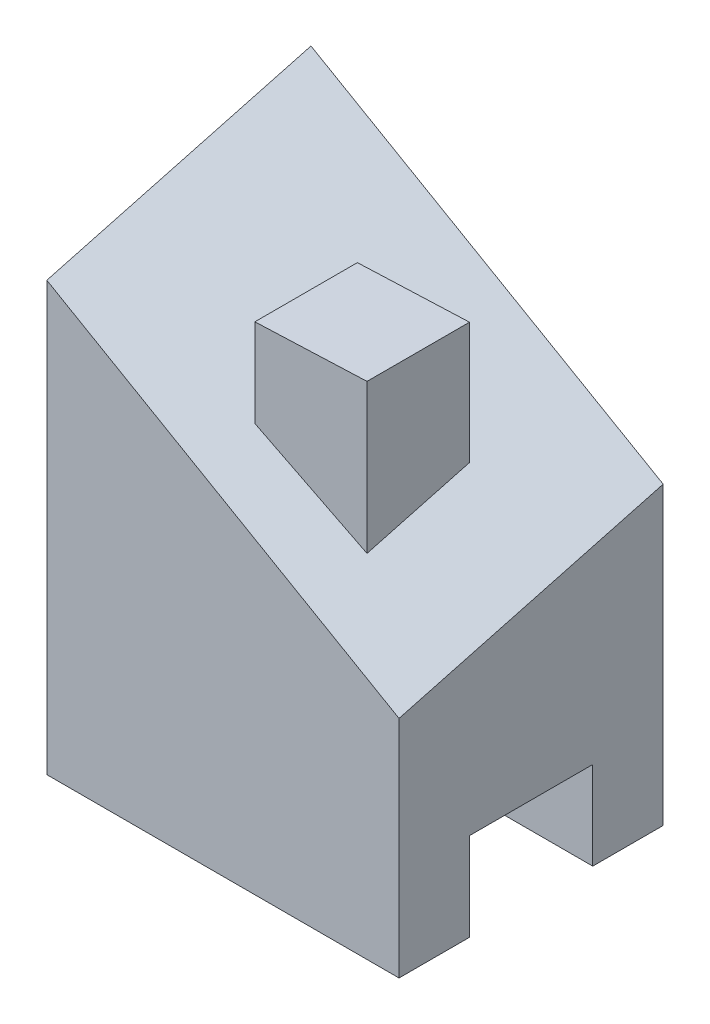
ISO-10303-21;
HEADER;
FILE_DESCRIPTION(('STEP AP214'),'2;1');
FILE_NAME('part.step','',(''),(''),'','','');
FILE_SCHEMA(('AUTOMOTIVE_DESIGN { 1 0 10303 214 1 1 1 1 }'));
ENDSEC;
DATA;
#1=APPLICATION_CONTEXT('core data for automotive mechanical design processes');
#2=APPLICATION_PROTOCOL_DEFINITION('international standard','automotive_design',2000,#1);
#3=PRODUCT_CONTEXT('',#1,'mechanical');
#4=PRODUCT('Part','Part','',(#3));
#5=PRODUCT_RELATED_PRODUCT_CATEGORY('part','',(#4));
#6=PRODUCT_DEFINITION_FORMATION('','',#4);
#7=PRODUCT_DEFINITION_CONTEXT('part definition',#1,'design');
#8=PRODUCT_DEFINITION('design','',#6,#7);
#9=PRODUCT_DEFINITION_SHAPE('','',#8);
#10=(LENGTH_UNIT() NAMED_UNIT(*) SI_UNIT(.MILLI.,.METRE.));
#11=(NAMED_UNIT(*) PLANE_ANGLE_UNIT() SI_UNIT($,.RADIAN.));
#12=(NAMED_UNIT(*) SI_UNIT($,.STERADIAN.) SOLID_ANGLE_UNIT());
#13=UNCERTAINTY_MEASURE_WITH_UNIT(LENGTH_MEASURE(1.E-05),#10,'distance_accuracy_value','');
#14=(GEOMETRIC_REPRESENTATION_CONTEXT(3) GLOBAL_UNCERTAINTY_ASSIGNED_CONTEXT((#13)) GLOBAL_UNIT_ASSIGNED_CONTEXT((#10,
#11,#12)) REPRESENTATION_CONTEXT('',''));
#15=CARTESIAN_POINT('',(0.,0.,0.));
#16=DIRECTION('',(0.,0.,1.));
#17=DIRECTION('',(1.,0.,0.));
#18=AXIS2_PLACEMENT_3D('',#15,#16,#17);
#19=CARTESIAN_POINT('',(0.,0.,0.));
#20=DIRECTION('',(0.,1.,0.));
#21=DIRECTION('',(0.,0.,1.));
#22=AXIS2_PLACEMENT_3D('',#19,#20,#21);
#23=PLANE('',#22);
#24=DIRECTION('',(0.,0.,1.));
#25=VECTOR('',#24,1.);
#26=CARTESIAN_POINT('',(0.,0.,-45.));
#27=LINE('',#26,#25);
#28=CARTESIAN_POINT('',(0.,0.,-12.));
#29=VERTEX_POINT('',#28);
#30=CARTESIAN_POINT('',(0.,0.,0.));
#31=VERTEX_POINT('',#30);
#32=EDGE_CURVE('E210',#29,#31,#27,.T.);
#33=ORIENTED_EDGE('',*,*,#32,.F.);
#34=DIRECTION('',(1.,0.,0.));
#35=VECTOR('',#34,1.);
#36=CARTESIAN_POINT('',(0.,0.,-12.));
#37=LINE('',#36,#35);
#38=CARTESIAN_POINT('',(60.,0.,-12.));
#39=VERTEX_POINT('',#38);
#40=EDGE_CURVE('E243',#29,#39,#37,.T.);
#41=ORIENTED_EDGE('',*,*,#40,.T.);
#42=DIRECTION('',(0.,0.,-1.));
#43=VECTOR('',#42,1.);
#44=CARTESIAN_POINT('',(60.,0.,0.));
#45=LINE('',#44,#43);
#46=CARTESIAN_POINT('',(60.,0.,0.));
#47=VERTEX_POINT('',#46);
#48=EDGE_CURVE('E220',#47,#39,#45,.T.);
#49=ORIENTED_EDGE('',*,*,#48,.F.);
#50=DIRECTION('',(1.,0.,0.));
#51=VECTOR('',#50,1.);
#52=CARTESIAN_POINT('',(0.,0.,0.));
#53=LINE('',#52,#51);
#54=EDGE_CURVE('E215',#31,#47,#53,.T.);
#55=ORIENTED_EDGE('',*,*,#54,.F.);
#56=EDGE_LOOP('',(#33,#41,#49,#55));
#57=FACE_BOUND('',#56,.T.);
#58=ADVANCED_FACE('F41',(#57),#23,.F.);
#59=CARTESIAN_POINT('',(0.,85.,-45.));
#60=DIRECTION('',(1.,0.,0.));
#61=DIRECTION('',(0.,0.,-1.));
#62=AXIS2_PLACEMENT_3D('',#59,#60,#61);
#63=PLANE('',#62);
#64=DIRECTION('',(0.,-1.,0.));
#65=VECTOR('',#64,1.);
#66=CARTESIAN_POINT('',(0.,85.,0.));
#67=LINE('',#66,#65);
#68=CARTESIAN_POINT('',(0.,72.9422863405998,0.));
#69=VERTEX_POINT('',#68);
#70=EDGE_CURVE('E237',#69,#31,#67,.T.);
#71=ORIENTED_EDGE('',*,*,#70,.F.);
#72=DIRECTION('',(0.,-0.258819045102514,0.96592582628907));
#73=VECTOR('',#72,1.);
#74=CARTESIAN_POINT('',(0.,85.,-45.));
#75=LINE('',#74,#73);
#76=CARTESIAN_POINT('',(0.,85.,-45.));
#77=VERTEX_POINT('',#76);
#78=EDGE_CURVE('E176',#77,#69,#75,.T.);
#79=ORIENTED_EDGE('',*,*,#78,.F.);
#80=DIRECTION('',(0.,-1.,0.));
#81=VECTOR('',#80,1.);
#82=CARTESIAN_POINT('',(0.,85.,-45.));
#83=LINE('',#82,#81);
#84=CARTESIAN_POINT('',(0.,0.,-45.));
#85=VERTEX_POINT('',#84);
#86=EDGE_CURVE('E227',#77,#85,#83,.T.);
#87=ORIENTED_EDGE('',*,*,#86,.T.);
#88=CARTESIAN_POINT('',(0.,0.,-33.));
#89=VERTEX_POINT('',#88);
#90=EDGE_CURVE('E211',#85,#89,#27,.T.);
#91=ORIENTED_EDGE('',*,*,#90,.T.);
#92=DIRECTION('',(0.,1.,0.));
#93=VECTOR('',#92,1.);
#94=CARTESIAN_POINT('',(0.,85.,-33.));
#95=LINE('',#94,#93);
#96=CARTESIAN_POINT('',(0.,15.,-33.));
#97=VERTEX_POINT('',#96);
#98=EDGE_CURVE('E65',#89,#97,#95,.T.);
#99=ORIENTED_EDGE('',*,*,#98,.T.);
#100=DIRECTION('',(0.,0.,1.));
#101=VECTOR('',#100,1.);
#102=CARTESIAN_POINT('',(0.,15.,-45.));
#103=LINE('',#102,#101);
#104=CARTESIAN_POINT('',(0.,15.,-12.));
#105=VERTEX_POINT('',#104);
#106=EDGE_CURVE('E206',#97,#105,#103,.T.);
#107=ORIENTED_EDGE('',*,*,#106,.T.);
#108=DIRECTION('',(0.,-1.,0.));
#109=VECTOR('',#108,1.);
#110=CARTESIAN_POINT('',(0.,85.,-12.));
#111=LINE('',#110,#109);
#112=EDGE_CURVE('E202',#105,#29,#111,.T.);
#113=ORIENTED_EDGE('',*,*,#112,.T.);
#114=ORIENTED_EDGE('',*,*,#32,.T.);
#115=EDGE_LOOP('',(#71,#79,#87,#91,#99,#107,#113,#114));
#116=FACE_BOUND('',#115,.T.);
#117=ADVANCED_FACE('F43',(#116),#63,.F.);
#118=CARTESIAN_POINT('',(0.,85.,0.));
#119=DIRECTION('',(0.,0.,-1.));
#120=DIRECTION('',(-1.,0.,0.));
#121=AXIS2_PLACEMENT_3D('',#118,#119,#120);
#122=PLANE('',#121);
#123=DIRECTION('',(0.,-1.,0.));
#124=VECTOR('',#123,1.);
#125=CARTESIAN_POINT('',(60.,85.,0.));
#126=LINE('',#125,#124);
#127=CARTESIAN_POINT('',(60.,38.3012701892228,0.));
#128=VERTEX_POINT('',#127);
#129=EDGE_CURVE('E234',#128,#47,#126,.T.);
#130=ORIENTED_EDGE('',*,*,#129,.F.);
#131=DIRECTION('',(0.866025403784442,-0.499999999999994,0.));
#132=VECTOR('',#131,1.);
#133=CARTESIAN_POINT('',(60.,38.3012701892228,0.));
#134=LINE('',#133,#132);
#135=EDGE_CURVE('E164',#69,#128,#134,.T.);
#136=ORIENTED_EDGE('',*,*,#135,.F.);
#137=ORIENTED_EDGE('',*,*,#70,.T.);
#138=ORIENTED_EDGE('',*,*,#54,.T.);
#139=EDGE_LOOP('',(#130,#136,#137,#138));
#140=FACE_BOUND('',#139,.T.);
#141=ADVANCED_FACE('F276',(#140),#122,.F.);
#142=CARTESIAN_POINT('',(60.,85.,0.));
#143=DIRECTION('',(-1.,0.,0.));
#144=DIRECTION('',(0.,0.,1.));
#145=AXIS2_PLACEMENT_3D('',#142,#143,#144);
#146=PLANE('',#145);
#147=DIRECTION('',(0.,-1.,0.));
#148=VECTOR('',#147,1.);
#149=CARTESIAN_POINT('',(60.,85.,-45.));
#150=LINE('',#149,#148);
#151=CARTESIAN_POINT('',(60.,50.358983848623,-45.));
#152=VERTEX_POINT('',#151);
#153=CARTESIAN_POINT('',(60.,0.,-45.));
#154=VERTEX_POINT('',#153);
#155=EDGE_CURVE('E231',#152,#154,#150,.T.);
#156=ORIENTED_EDGE('',*,*,#155,.F.);
#157=DIRECTION('',(0.,0.258819045102514,-0.96592582628907));
#158=VECTOR('',#157,1.);
#159=CARTESIAN_POINT('',(60.,50.358983848623,-45.));
#160=LINE('',#159,#158);
#161=EDGE_CURVE('E173',#128,#152,#160,.T.);
#162=ORIENTED_EDGE('',*,*,#161,.F.);
#163=ORIENTED_EDGE('',*,*,#129,.T.);
#164=ORIENTED_EDGE('',*,*,#48,.T.);
#165=DIRECTION('',(0.,-1.,0.));
#166=VECTOR('',#165,1.);
#167=CARTESIAN_POINT('',(60.,0.,-12.));
#168=LINE('',#167,#166);
#169=CARTESIAN_POINT('',(60.,15.,-12.));
#170=VERTEX_POINT('',#169);
#171=EDGE_CURVE('E191',#170,#39,#168,.T.);
#172=ORIENTED_EDGE('',*,*,#171,.F.);
#173=DIRECTION('',(0.,0.,1.));
#174=VECTOR('',#173,1.);
#175=CARTESIAN_POINT('',(60.,15.,-12.));
#176=LINE('',#175,#174);
#177=CARTESIAN_POINT('',(60.,15.,-33.));
#178=VERTEX_POINT('',#177);
#179=EDGE_CURVE('E187',#178,#170,#176,.T.);
#180=ORIENTED_EDGE('',*,*,#179,.F.);
#181=DIRECTION('',(0.,1.,0.));
#182=VECTOR('',#181,1.);
#183=CARTESIAN_POINT('',(60.,15.,-33.));
#184=LINE('',#183,#182);
#185=CARTESIAN_POINT('',(60.,0.,-33.));
#186=VERTEX_POINT('',#185);
#187=EDGE_CURVE('E183',#186,#178,#184,.T.);
#188=ORIENTED_EDGE('',*,*,#187,.F.);
#189=EDGE_CURVE('E219',#186,#154,#45,.T.);
#190=ORIENTED_EDGE('',*,*,#189,.T.);
#191=EDGE_LOOP('',(#156,#162,#163,#164,#172,#180,#188,#190));
#192=FACE_BOUND('',#191,.T.);
#193=ADVANCED_FACE('F292',(#192),#146,.F.);
#194=CARTESIAN_POINT('',(60.,85.,-45.));
#195=DIRECTION('',(0.,0.,1.));
#196=DIRECTION('',(1.,0.,0.));
#197=AXIS2_PLACEMENT_3D('',#194,#195,#196);
#198=PLANE('',#197);
#199=ORIENTED_EDGE('',*,*,#86,.F.);
#200=DIRECTION('',(0.866025403784442,-0.499999999999995,0.));
#201=VECTOR('',#200,1.);
#202=CARTESIAN_POINT('',(45.0000000000003,59.019237886467,-45.));
#203=LINE('',#202,#201);
#204=EDGE_CURVE('E179',#77,#152,#203,.T.);
#205=ORIENTED_EDGE('',*,*,#204,.T.);
#206=ORIENTED_EDGE('',*,*,#155,.T.);
#207=DIRECTION('',(-1.,0.,0.));
#208=VECTOR('',#207,1.);
#209=CARTESIAN_POINT('',(60.,0.,-45.));
#210=LINE('',#209,#208);
#211=EDGE_CURVE('E224',#154,#85,#210,.T.);
#212=ORIENTED_EDGE('',*,*,#211,.T.);
#213=EDGE_LOOP('',(#199,#205,#206,#212));
#214=FACE_BOUND('',#213,.T.);
#215=ADVANCED_FACE('F283',(#214),#198,.F.);
#216=ORIENTED_EDGE('',*,*,#189,.F.);
#217=DIRECTION('',(-1.,0.,0.));
#218=VECTOR('',#217,1.);
#219=CARTESIAN_POINT('',(0.,0.,-33.));
#220=LINE('',#219,#218);
#221=EDGE_CURVE('E240',#186,#89,#220,.T.);
#222=ORIENTED_EDGE('',*,*,#221,.T.);
#223=ORIENTED_EDGE('',*,*,#90,.F.);
#224=ORIENTED_EDGE('',*,*,#211,.F.);
#225=EDGE_LOOP('',(#216,#222,#223,#224));
#226=FACE_BOUND('',#225,.T.);
#227=ADVANCED_FACE('F272',(#226),#23,.F.);
#228=CARTESIAN_POINT('',(-25.,15.,-12.));
#229=DIRECTION('',(0.,1.,0.));
#230=DIRECTION('',(0.,0.,1.));
#231=AXIS2_PLACEMENT_3D('',#228,#229,#230);
#232=PLANE('',#231);
#233=DIRECTION('',(1.,0.,0.));
#234=VECTOR('',#233,1.);
#235=CARTESIAN_POINT('',(-25.,15.,-33.));
#236=LINE('',#235,#234);
#237=EDGE_CURVE('E194',#97,#178,#236,.T.);
#238=ORIENTED_EDGE('',*,*,#237,.T.);
#239=ORIENTED_EDGE('',*,*,#179,.T.);
#240=DIRECTION('',(1.,0.,0.));
#241=VECTOR('',#240,1.);
#242=CARTESIAN_POINT('',(-25.,15.,-12.));
#243=LINE('',#242,#241);
#244=EDGE_CURVE('E195',#105,#170,#243,.T.);
#245=ORIENTED_EDGE('',*,*,#244,.F.);
#246=ORIENTED_EDGE('',*,*,#106,.F.);
#247=EDGE_LOOP('',(#238,#239,#245,#246));
#248=FACE_BOUND('',#247,.T.);
#249=ADVANCED_FACE('F282',(#248),#232,.F.);
#250=CARTESIAN_POINT('',(-25.,0.,-12.));
#251=DIRECTION('',(0.,0.,1.));
#252=DIRECTION('',(1.,0.,0.));
#253=AXIS2_PLACEMENT_3D('',#250,#251,#252);
#254=PLANE('',#253);
#255=ORIENTED_EDGE('',*,*,#244,.T.);
#256=ORIENTED_EDGE('',*,*,#171,.T.);
#257=ORIENTED_EDGE('',*,*,#40,.F.);
#258=ORIENTED_EDGE('',*,*,#112,.F.);
#259=EDGE_LOOP('',(#255,#256,#257,#258));
#260=FACE_BOUND('',#259,.T.);
#261=ADVANCED_FACE('F289',(#260),#254,.F.);
#262=CARTESIAN_POINT('',(-25.,15.,-33.));
#263=DIRECTION('',(0.,0.,-1.));
#264=DIRECTION('',(-1.,0.,0.));
#265=AXIS2_PLACEMENT_3D('',#262,#263,#264);
#266=PLANE('',#265);
#267=ORIENTED_EDGE('',*,*,#221,.F.);
#268=ORIENTED_EDGE('',*,*,#187,.T.);
#269=ORIENTED_EDGE('',*,*,#237,.F.);
#270=ORIENTED_EDGE('',*,*,#98,.F.);
#271=EDGE_LOOP('',(#267,#268,#269,#270));
#272=FACE_BOUND('',#271,.T.);
#273=ADVANCED_FACE('F314',(#272),#266,.F.);
#274=CARTESIAN_POINT('',(29.9710671363496,51.9114110372161,13.9096206653817));
#275=DIRECTION('',(-0.487058473848144,-0.843610022961955,-0.22604462437945));
#276=DIRECTION('',(0.866025403784442,-0.499999999999995,0.));
#277=AXIS2_PLACEMENT_3D('',#274,#275,#276);
#278=PLANE('',#277);
#279=DIRECTION('',(-0.869631470400552,0.492368809157419,0.0362499856259123));
#280=VECTOR('',#279,1.);
#281=CARTESIAN_POINT('',(31.9103328922819,57.0584594116458,-9.47796234537295));
#282=LINE('',#281,#280);
#283=CARTESIAN_POINT('',(44.5418374787134,49.9067416061446,-10.0044978667713));
#284=VERTEX_POINT('',#283);
#285=CARTESIAN_POINT('',(26.2010808698314,60.2909293890475,-9.23997612846061));
#286=VERTEX_POINT('',#285);
#287=EDGE_CURVE('E50',#284,#286,#282,.T.);
#288=ORIENTED_EDGE('',*,*,#287,.T.);
#289=DIRECTION('',(0.,0.258819045102514,-0.96592582628907));
#290=VECTOR('',#289,1.);
#291=CARTESIAN_POINT('',(26.2010808698314,53.9422088967534,14.4537713118356));
#292=LINE('',#291,#290);
#293=CARTESIAN_POINT('',(26.2010808698314,64.9696966339312,-26.7013732031559));
#294=VERTEX_POINT('',#293);
#295=EDGE_CURVE('E11',#286,#294,#292,.T.);
#296=ORIENTED_EDGE('',*,*,#295,.T.);
#297=DIRECTION('',(0.869631470400552,-0.492368809157419,-0.0362499856259126));
#298=VECTOR('',#297,1.);
#299=CARTESIAN_POINT('',(33.3632293759681,60.9146242831676,-26.9999224038634));
#300=LINE('',#299,#298);
#301=CARTESIAN_POINT('',(44.5418374787134,54.5855088510283,-27.4658949414666));
#302=VERTEX_POINT('',#301);
#303=EDGE_CURVE('E135',#294,#302,#300,.T.);
#304=ORIENTED_EDGE('',*,*,#303,.T.);
#305=DIRECTION('',(0.,-0.258819045102514,0.96592582628907));
#306=VECTOR('',#305,1.);
#307=CARTESIAN_POINT('',(44.5418374787134,44.0624993618933,11.8065111205158));
#308=LINE('',#307,#306);
#309=EDGE_CURVE('E249',#302,#284,#308,.T.);
#310=ORIENTED_EDGE('',*,*,#309,.T.);
#311=EDGE_LOOP('',(#288,#296,#304,#310));
#312=FACE_BOUND('',#311,.T.);
#313=ORIENTED_EDGE('',*,*,#204,.F.);
#314=ORIENTED_EDGE('',*,*,#78,.T.);
#315=ORIENTED_EDGE('',*,*,#135,.T.);
#316=ORIENTED_EDGE('',*,*,#161,.T.);
#317=EDGE_LOOP('',(#313,#314,#315,#316));
#318=FACE_BOUND('',#317,.T.);
#319=ADVANCED_FACE('F255',(#312,#318),#278,.F.);
#320=CARTESIAN_POINT('',(26.2010808698314,75.2909293890475,-26.7013732031559));
#321=DIRECTION('',(-1.,0.,0.));
#322=DIRECTION('',(0.,0.,1.));
#323=AXIS2_PLACEMENT_3D('',#320,#321,#322);
#324=PLANE('',#323);
#325=ORIENTED_EDGE('',*,*,#295,.F.);
#326=DIRECTION('',(0.,-1.,0.));
#327=VECTOR('',#326,1.);
#328=CARTESIAN_POINT('',(26.2010808698314,75.2909293890475,-9.23997612846061));
#329=LINE('',#328,#327);
#330=CARTESIAN_POINT('',(26.2010808698314,75.2909293890475,-9.23997612846061));
#331=VERTEX_POINT('',#330);
#332=EDGE_CURVE('E154',#331,#286,#329,.T.);
#333=ORIENTED_EDGE('',*,*,#332,.F.);
#334=DIRECTION('',(0.,0.,-1.));
#335=VECTOR('',#334,1.);
#336=CARTESIAN_POINT('',(26.2010808698314,75.2909293890475,-26.7013732031559));
#337=LINE('',#336,#335);
#338=CARTESIAN_POINT('',(26.2010808698314,75.2909293890475,-26.7013732031559));
#339=VERTEX_POINT('',#338);
#340=EDGE_CURVE('E146',#331,#339,#337,.T.);
#341=ORIENTED_EDGE('',*,*,#340,.T.);
#342=DIRECTION('',(0.,-1.,0.));
#343=VECTOR('',#342,1.);
#344=CARTESIAN_POINT('',(26.2010808698314,75.2909293890475,-26.7013732031559));
#345=LINE('',#344,#343);
#346=EDGE_CURVE('E130',#339,#294,#345,.T.);
#347=ORIENTED_EDGE('',*,*,#346,.T.);
#348=EDGE_LOOP('',(#325,#333,#341,#347));
#349=FACE_BOUND('',#348,.T.);
#350=ADVANCED_FACE('F152',(#349),#324,.T.);
#351=CARTESIAN_POINT('',(26.2010808698314,75.2909293890475,-9.23997612846061));
#352=DIRECTION('',(0.0416481396883309,0.,0.999132339813151));
#353=DIRECTION('',(0.999132339813151,0.,-0.0416481396883309));
#354=AXIS2_PLACEMENT_3D('',#351,#352,#353);
#355=PLANE('',#354);
#356=ORIENTED_EDGE('',*,*,#287,.F.);
#357=DIRECTION('',(0.,-1.,0.));
#358=VECTOR('',#357,1.);
#359=CARTESIAN_POINT('',(44.5418374787134,75.2909293890475,-10.0044978667713));
#360=LINE('',#359,#358);
#361=CARTESIAN_POINT('',(44.5418374787134,75.2909293890475,-10.0044978667713));
#362=VERTEX_POINT('',#361);
#363=EDGE_CURVE('E165',#362,#284,#360,.T.);
#364=ORIENTED_EDGE('',*,*,#363,.F.);
#365=DIRECTION('',(-0.999132339813151,0.,0.0416481396883309));
#366=VECTOR('',#365,1.);
#367=CARTESIAN_POINT('',(26.2010808698314,75.2909293890475,-9.23997612846061));
#368=LINE('',#367,#366);
#369=EDGE_CURVE('E139',#362,#331,#368,.T.);
#370=ORIENTED_EDGE('',*,*,#369,.T.);
#371=ORIENTED_EDGE('',*,*,#332,.T.);
#372=EDGE_LOOP('',(#356,#364,#370,#371));
#373=FACE_BOUND('',#372,.T.);
#374=ADVANCED_FACE('F258',(#373),#355,.T.);
#375=CARTESIAN_POINT('',(44.5418374787134,75.2909293890475,-10.0044978667713));
#376=DIRECTION('',(1.,0.,0.));
#377=DIRECTION('',(0.,0.,-1.));
#378=AXIS2_PLACEMENT_3D('',#375,#376,#377);
#379=PLANE('',#378);
#380=ORIENTED_EDGE('',*,*,#309,.F.);
#381=DIRECTION('',(0.,-1.,0.));
#382=VECTOR('',#381,1.);
#383=CARTESIAN_POINT('',(44.5418374787134,75.2909293890475,-27.4658949414666));
#384=LINE('',#383,#382);
#385=CARTESIAN_POINT('',(44.5418374787134,75.2909293890475,-27.4658949414666));
#386=VERTEX_POINT('',#385);
#387=EDGE_CURVE('E57',#386,#302,#384,.T.);
#388=ORIENTED_EDGE('',*,*,#387,.F.);
#389=DIRECTION('',(0.,0.,1.));
#390=VECTOR('',#389,1.);
#391=CARTESIAN_POINT('',(44.5418374787134,75.2909293890475,-10.0044978667713));
#392=LINE('',#391,#390);
#393=EDGE_CURVE('E149',#386,#362,#392,.T.);
#394=ORIENTED_EDGE('',*,*,#393,.T.);
#395=ORIENTED_EDGE('',*,*,#363,.T.);
#396=EDGE_LOOP('',(#380,#388,#394,#395));
#397=FACE_BOUND('',#396,.T.);
#398=ADVANCED_FACE('F260',(#397),#379,.T.);
#399=CARTESIAN_POINT('',(44.5418374787134,75.2909293890475,-27.4658949414666));
#400=DIRECTION('',(-0.0416481396883313,0.,-0.999132339813151));
#401=DIRECTION('',(-0.999132339813151,0.,0.0416481396883313));
#402=AXIS2_PLACEMENT_3D('',#399,#400,#401);
#403=PLANE('',#402);
#404=ORIENTED_EDGE('',*,*,#303,.F.);
#405=ORIENTED_EDGE('',*,*,#346,.F.);
#406=DIRECTION('',(0.999132339813151,0.,-0.0416481396883313));
#407=VECTOR('',#406,1.);
#408=CARTESIAN_POINT('',(44.5418374787134,75.2909293890475,-27.4658949414666));
#409=LINE('',#408,#407);
#410=EDGE_CURVE('E133',#339,#386,#409,.T.);
#411=ORIENTED_EDGE('',*,*,#410,.T.);
#412=ORIENTED_EDGE('',*,*,#387,.T.);
#413=EDGE_LOOP('',(#404,#405,#411,#412));
#414=FACE_BOUND('',#413,.T.);
#415=ADVANCED_FACE('F132',(#414),#403,.T.);
#416=CARTESIAN_POINT('',(0.,75.2909293890475,0.));
#417=DIRECTION('',(0.,1.,0.));
#418=DIRECTION('',(0.,0.,1.));
#419=AXIS2_PLACEMENT_3D('',#416,#417,#418);
#420=PLANE('',#419);
#421=ORIENTED_EDGE('',*,*,#340,.F.);
#422=ORIENTED_EDGE('',*,*,#369,.F.);
#423=ORIENTED_EDGE('',*,*,#393,.F.);
#424=ORIENTED_EDGE('',*,*,#410,.F.);
#425=EDGE_LOOP('',(#421,#422,#423,#424));
#426=FACE_BOUND('',#425,.T.);
#427=ADVANCED_FACE('F144',(#426),#420,.T.);
#428=CLOSED_SHELL('',(#58,#117,#141,#193,#215,#227,#249,#261,#273,#319,#350,#374,#398,#415,#427));
#429=MANIFOLD_SOLID_BREP('B2',#428);
#430=ADVANCED_BREP_SHAPE_REPRESENTATION('',(#18,#429),#14);
#431=SHAPE_DEFINITION_REPRESENTATION(#9,#430);
ENDSEC;
END-ISO-10303-21;
